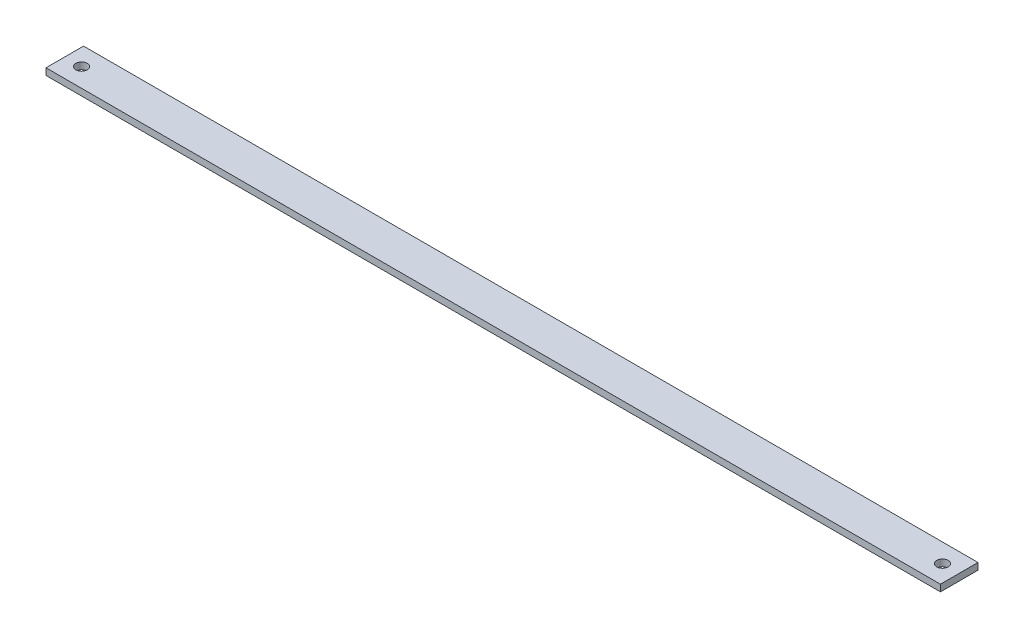
ISO-10303-21;
HEADER;
FILE_DESCRIPTION(('STEP AP214'),'2;1');
FILE_NAME('part.step','',(''),(''),'','','');
FILE_SCHEMA(('AUTOMOTIVE_DESIGN { 1 0 10303 214 1 1 1 1 }'));
ENDSEC;
DATA;
#1=APPLICATION_CONTEXT('core data for automotive mechanical design processes');
#2=APPLICATION_PROTOCOL_DEFINITION('international standard','automotive_design',2000,#1);
#3=PRODUCT_CONTEXT('',#1,'mechanical');
#4=PRODUCT('Part','Part','',(#3));
#5=PRODUCT_RELATED_PRODUCT_CATEGORY('part','',(#4));
#6=PRODUCT_DEFINITION_FORMATION('','',#4);
#7=PRODUCT_DEFINITION_CONTEXT('part definition',#1,'design');
#8=PRODUCT_DEFINITION('design','',#6,#7);
#9=PRODUCT_DEFINITION_SHAPE('','',#8);
#10=(LENGTH_UNIT() NAMED_UNIT(*) SI_UNIT(.MILLI.,.METRE.));
#11=(NAMED_UNIT(*) PLANE_ANGLE_UNIT() SI_UNIT($,.RADIAN.));
#12=(NAMED_UNIT(*) SI_UNIT($,.STERADIAN.) SOLID_ANGLE_UNIT());
#13=UNCERTAINTY_MEASURE_WITH_UNIT(LENGTH_MEASURE(1.E-05),#10,'distance_accuracy_value','');
#14=(GEOMETRIC_REPRESENTATION_CONTEXT(3) GLOBAL_UNCERTAINTY_ASSIGNED_CONTEXT((#13)) GLOBAL_UNIT_ASSIGNED_CONTEXT((#10,
#11,#12)) REPRESENTATION_CONTEXT('',''));
#15=CARTESIAN_POINT('',(0.,0.,0.));
#16=DIRECTION('',(0.,0.,1.));
#17=DIRECTION('',(1.,0.,0.));
#18=AXIS2_PLACEMENT_3D('',#15,#16,#17);
#19=CARTESIAN_POINT('',(0.,3.,0.));
#20=DIRECTION('',(0.,1.,0.));
#21=DIRECTION('',(0.,0.,1.));
#22=AXIS2_PLACEMENT_3D('',#19,#20,#21);
#23=PLANE('',#22);
#24=CARTESIAN_POINT('',(-192.5,3.,0.));
#25=DIRECTION('',(0.,1.,0.));
#26=DIRECTION('',(0.,0.,1.));
#27=AXIS2_PLACEMENT_3D('',#24,#25,#26);
#28=CIRCLE('',#27,2.54999999999999);
#29=CARTESIAN_POINT('',(-192.5,3.,2.54999999999999));
#30=VERTEX_POINT('',#29);
#31=EDGE_CURVE('E102',#30,#30,#28,.T.);
#32=ORIENTED_EDGE('',*,*,#31,.F.);
#33=EDGE_LOOP('',(#32));
#34=FACE_BOUND('',#33,.T.);
#35=DIRECTION('',(0.,0.,-1.));
#36=VECTOR('',#35,1.);
#37=CARTESIAN_POINT('',(200.,3.,-8.4));
#38=LINE('',#37,#36);
#39=CARTESIAN_POINT('',(200.,3.,8.4));
#40=VERTEX_POINT('',#39);
#41=CARTESIAN_POINT('',(200.,3.,-8.4));
#42=VERTEX_POINT('',#41);
#43=EDGE_CURVE('E87',#40,#42,#38,.T.);
#44=ORIENTED_EDGE('',*,*,#43,.T.);
#45=DIRECTION('',(-1.,0.,0.));
#46=VECTOR('',#45,1.);
#47=CARTESIAN_POINT('',(-200.,3.,-8.4));
#48=LINE('',#47,#46);
#49=CARTESIAN_POINT('',(-200.,3.,-8.4));
#50=VERTEX_POINT('',#49);
#51=EDGE_CURVE('E82',#42,#50,#48,.T.);
#52=ORIENTED_EDGE('',*,*,#51,.T.);
#53=DIRECTION('',(0.,0.,1.));
#54=VECTOR('',#53,1.);
#55=CARTESIAN_POINT('',(-200.,3.,-8.4));
#56=LINE('',#55,#54);
#57=CARTESIAN_POINT('',(-200.,3.,8.4));
#58=VERTEX_POINT('',#57);
#59=EDGE_CURVE('E85',#50,#58,#56,.T.);
#60=ORIENTED_EDGE('',*,*,#59,.T.);
#61=DIRECTION('',(1.,0.,0.));
#62=VECTOR('',#61,1.);
#63=CARTESIAN_POINT('',(-200.,3.,8.4));
#64=LINE('',#63,#62);
#65=EDGE_CURVE('E52',#58,#40,#64,.T.);
#66=ORIENTED_EDGE('',*,*,#65,.T.);
#67=EDGE_LOOP('',(#44,#52,#60,#66));
#68=FACE_BOUND('',#67,.T.);
#69=CARTESIAN_POINT('',(192.5,3.,0.));
#70=DIRECTION('',(0.,1.,0.));
#71=DIRECTION('',(0.,0.,1.));
#72=AXIS2_PLACEMENT_3D('',#69,#70,#71);
#73=CIRCLE('',#72,2.54999999999999);
#74=CARTESIAN_POINT('',(192.5,3.,2.54999999999999));
#75=VERTEX_POINT('',#74);
#76=EDGE_CURVE('E117',#75,#75,#73,.T.);
#77=ORIENTED_EDGE('',*,*,#76,.F.);
#78=EDGE_LOOP('',(#77));
#79=FACE_BOUND('',#78,.T.);
#80=ADVANCED_FACE('F35',(#34,#68,#79),#23,.T.);
#81=CARTESIAN_POINT('',(0.,0.,0.));
#82=DIRECTION('',(0.,1.,0.));
#83=DIRECTION('',(0.,0.,1.));
#84=AXIS2_PLACEMENT_3D('',#81,#82,#83);
#85=PLANE('',#84);
#86=DIRECTION('',(0.,0.,-1.));
#87=VECTOR('',#86,1.);
#88=CARTESIAN_POINT('',(200.,0.,-8.4));
#89=LINE('',#88,#87);
#90=CARTESIAN_POINT('',(200.,0.,8.4));
#91=VERTEX_POINT('',#90);
#92=CARTESIAN_POINT('',(200.,0.,-8.4));
#93=VERTEX_POINT('',#92);
#94=EDGE_CURVE('E99',#91,#93,#89,.T.);
#95=ORIENTED_EDGE('',*,*,#94,.F.);
#96=DIRECTION('',(1.,0.,0.));
#97=VECTOR('',#96,1.);
#98=CARTESIAN_POINT('',(-200.,0.,8.4));
#99=LINE('',#98,#97);
#100=CARTESIAN_POINT('',(-200.,0.,8.4));
#101=VERTEX_POINT('',#100);
#102=EDGE_CURVE('E75',#101,#91,#99,.T.);
#103=ORIENTED_EDGE('',*,*,#102,.F.);
#104=DIRECTION('',(0.,0.,1.));
#105=VECTOR('',#104,1.);
#106=CARTESIAN_POINT('',(-200.,0.,-8.4));
#107=LINE('',#106,#105);
#108=CARTESIAN_POINT('',(-200.,0.,-8.4));
#109=VERTEX_POINT('',#108);
#110=EDGE_CURVE('E69',#109,#101,#107,.T.);
#111=ORIENTED_EDGE('',*,*,#110,.F.);
#112=DIRECTION('',(-1.,0.,0.));
#113=VECTOR('',#112,1.);
#114=CARTESIAN_POINT('',(-200.,0.,-8.4));
#115=LINE('',#114,#113);
#116=EDGE_CURVE('E91',#93,#109,#115,.T.);
#117=ORIENTED_EDGE('',*,*,#116,.F.);
#118=EDGE_LOOP('',(#95,#103,#111,#117));
#119=FACE_BOUND('',#118,.T.);
#120=CARTESIAN_POINT('',(-192.5,0.,0.));
#121=DIRECTION('',(0.,1.,0.));
#122=DIRECTION('',(0.,0.,1.));
#123=AXIS2_PLACEMENT_3D('',#120,#121,#122);
#124=CIRCLE('',#123,2.54999999999999);
#125=CARTESIAN_POINT('',(-192.5,0.,2.54999999999999));
#126=VERTEX_POINT('',#125);
#127=EDGE_CURVE('E114',#126,#126,#124,.T.);
#128=ORIENTED_EDGE('',*,*,#127,.T.);
#129=EDGE_LOOP('',(#128));
#130=FACE_BOUND('',#129,.T.);
#131=CARTESIAN_POINT('',(192.5,0.,0.));
#132=DIRECTION('',(0.,1.,0.));
#133=DIRECTION('',(0.,0.,1.));
#134=AXIS2_PLACEMENT_3D('',#131,#132,#133);
#135=CIRCLE('',#134,2.54999999999999);
#136=CARTESIAN_POINT('',(192.5,0.,2.54999999999999));
#137=VERTEX_POINT('',#136);
#138=EDGE_CURVE('E120',#137,#137,#135,.T.);
#139=ORIENTED_EDGE('',*,*,#138,.T.);
#140=EDGE_LOOP('',(#139));
#141=FACE_BOUND('',#140,.T.);
#142=ADVANCED_FACE('F110',(#119,#130,#141),#85,.F.);
#143=CARTESIAN_POINT('',(200.,3.,-8.4));
#144=DIRECTION('',(-1.,0.,0.));
#145=DIRECTION('',(0.,0.,1.));
#146=AXIS2_PLACEMENT_3D('',#143,#144,#145);
#147=PLANE('',#146);
#148=ORIENTED_EDGE('',*,*,#94,.T.);
#149=DIRECTION('',(0.,-1.,0.));
#150=VECTOR('',#149,1.);
#151=CARTESIAN_POINT('',(200.,3.,-8.4));
#152=LINE('',#151,#150);
#153=EDGE_CURVE('E11',#42,#93,#152,.T.);
#154=ORIENTED_EDGE('',*,*,#153,.F.);
#155=ORIENTED_EDGE('',*,*,#43,.F.);
#156=DIRECTION('',(0.,-1.,0.));
#157=VECTOR('',#156,1.);
#158=CARTESIAN_POINT('',(200.,3.,8.4));
#159=LINE('',#158,#157);
#160=EDGE_CURVE('E95',#40,#91,#159,.T.);
#161=ORIENTED_EDGE('',*,*,#160,.T.);
#162=EDGE_LOOP('',(#148,#154,#155,#161));
#163=FACE_BOUND('',#162,.T.);
#164=ADVANCED_FACE('F37',(#163),#147,.F.);
#165=CARTESIAN_POINT('',(-200.,3.,-8.4));
#166=DIRECTION('',(0.,0.,1.));
#167=DIRECTION('',(1.,0.,0.));
#168=AXIS2_PLACEMENT_3D('',#165,#166,#167);
#169=PLANE('',#168);
#170=ORIENTED_EDGE('',*,*,#116,.T.);
#171=DIRECTION('',(0.,-1.,0.));
#172=VECTOR('',#171,1.);
#173=CARTESIAN_POINT('',(-200.,3.,-8.4));
#174=LINE('',#173,#172);
#175=EDGE_CURVE('E44',#50,#109,#174,.T.);
#176=ORIENTED_EDGE('',*,*,#175,.F.);
#177=ORIENTED_EDGE('',*,*,#51,.F.);
#178=ORIENTED_EDGE('',*,*,#153,.T.);
#179=EDGE_LOOP('',(#170,#176,#177,#178));
#180=FACE_BOUND('',#179,.T.);
#181=ADVANCED_FACE('F90',(#180),#169,.F.);
#182=CARTESIAN_POINT('',(-200.,3.,-8.4));
#183=DIRECTION('',(1.,0.,0.));
#184=DIRECTION('',(0.,0.,-1.));
#185=AXIS2_PLACEMENT_3D('',#182,#183,#184);
#186=PLANE('',#185);
#187=ORIENTED_EDGE('',*,*,#110,.T.);
#188=DIRECTION('',(0.,-1.,0.));
#189=VECTOR('',#188,1.);
#190=CARTESIAN_POINT('',(-200.,3.,8.4));
#191=LINE('',#190,#189);
#192=EDGE_CURVE('E92',#58,#101,#191,.T.);
#193=ORIENTED_EDGE('',*,*,#192,.F.);
#194=ORIENTED_EDGE('',*,*,#59,.F.);
#195=ORIENTED_EDGE('',*,*,#175,.T.);
#196=EDGE_LOOP('',(#187,#193,#194,#195));
#197=FACE_BOUND('',#196,.T.);
#198=ADVANCED_FACE('F93',(#197),#186,.F.);
#199=CARTESIAN_POINT('',(-200.,3.,8.4));
#200=DIRECTION('',(0.,0.,-1.));
#201=DIRECTION('',(-1.,0.,0.));
#202=AXIS2_PLACEMENT_3D('',#199,#200,#201);
#203=PLANE('',#202);
#204=ORIENTED_EDGE('',*,*,#102,.T.);
#205=ORIENTED_EDGE('',*,*,#160,.F.);
#206=ORIENTED_EDGE('',*,*,#65,.F.);
#207=ORIENTED_EDGE('',*,*,#192,.T.);
#208=EDGE_LOOP('',(#204,#205,#206,#207));
#209=FACE_BOUND('',#208,.T.);
#210=ADVANCED_FACE('F107',(#209),#203,.F.);
#211=CARTESIAN_POINT('',(-192.5,3.,0.));
#212=DIRECTION('',(0.,-1.,0.));
#213=DIRECTION('',(0.,0.,-1.));
#214=AXIS2_PLACEMENT_3D('',#211,#212,#213);
#215=CYLINDRICAL_SURFACE('',#214,2.54999999999999);
#216=ORIENTED_EDGE('',*,*,#31,.T.);
#217=EDGE_LOOP('',(#216));
#218=FACE_BOUND('',#217,.T.);
#219=ORIENTED_EDGE('',*,*,#127,.F.);
#220=EDGE_LOOP('',(#219));
#221=FACE_BOUND('',#220,.T.);
#222=ADVANCED_FACE('F137',(#218,#221),#215,.F.);
#223=CARTESIAN_POINT('',(192.5,3.,0.));
#224=DIRECTION('',(0.,-1.,0.));
#225=DIRECTION('',(0.,0.,-1.));
#226=AXIS2_PLACEMENT_3D('',#223,#224,#225);
#227=CYLINDRICAL_SURFACE('',#226,2.54999999999999);
#228=ORIENTED_EDGE('',*,*,#76,.T.);
#229=EDGE_LOOP('',(#228));
#230=FACE_BOUND('',#229,.T.);
#231=ORIENTED_EDGE('',*,*,#138,.F.);
#232=EDGE_LOOP('',(#231));
#233=FACE_BOUND('',#232,.T.);
#234=ADVANCED_FACE('F126',(#230,#233),#227,.F.);
#235=CLOSED_SHELL('',(#80,#142,#164,#181,#198,#210,#222,#234));
#236=MANIFOLD_SOLID_BREP('B2',#235);
#237=ADVANCED_BREP_SHAPE_REPRESENTATION('',(#18,#236),#14);
#238=SHAPE_DEFINITION_REPRESENTATION(#9,#237);
ENDSEC;
END-ISO-10303-21;
